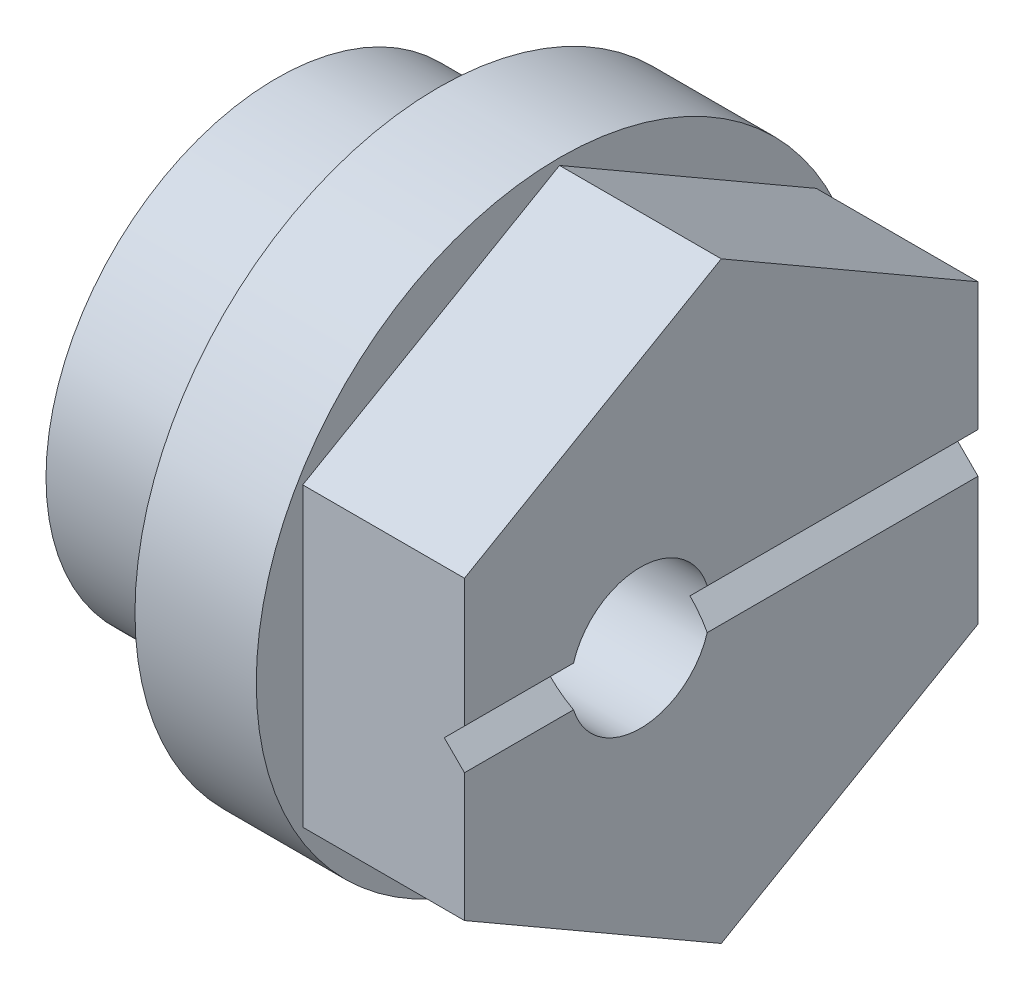
ISO-10303-21;
HEADER;
FILE_DESCRIPTION(('STEP AP214'),'2;1');
FILE_NAME('part.step','',(''),(''),'','','');
FILE_SCHEMA(('AUTOMOTIVE_DESIGN { 1 0 10303 214 1 1 1 1 }'));
ENDSEC;
DATA;
#1=APPLICATION_CONTEXT('core data for automotive mechanical design processes');
#2=APPLICATION_PROTOCOL_DEFINITION('international standard','automotive_design',2000,#1);
#3=PRODUCT_CONTEXT('',#1,'mechanical');
#4=PRODUCT('Part','Part','',(#3));
#5=PRODUCT_RELATED_PRODUCT_CATEGORY('part','',(#4));
#6=PRODUCT_DEFINITION_FORMATION('','',#4);
#7=PRODUCT_DEFINITION_CONTEXT('part definition',#1,'design');
#8=PRODUCT_DEFINITION('design','',#6,#7);
#9=PRODUCT_DEFINITION_SHAPE('','',#8);
#10=(LENGTH_UNIT() NAMED_UNIT(*) SI_UNIT(.MILLI.,.METRE.));
#11=(NAMED_UNIT(*) PLANE_ANGLE_UNIT() SI_UNIT($,.RADIAN.));
#12=(NAMED_UNIT(*) SI_UNIT($,.STERADIAN.) SOLID_ANGLE_UNIT());
#13=UNCERTAINTY_MEASURE_WITH_UNIT(LENGTH_MEASURE(1.E-05),#10,'distance_accuracy_value','');
#14=(GEOMETRIC_REPRESENTATION_CONTEXT(3) GLOBAL_UNCERTAINTY_ASSIGNED_CONTEXT((#13)) GLOBAL_UNIT_ASSIGNED_CONTEXT((#10,
#11,#12)) REPRESENTATION_CONTEXT('',''));
#15=CARTESIAN_POINT('',(0.,0.,0.));
#16=DIRECTION('',(0.,0.,1.));
#17=DIRECTION('',(1.,0.,0.));
#18=AXIS2_PLACEMENT_3D('',#15,#16,#17);
#19=CARTESIAN_POINT('',(10.5,0.,-7.5));
#20=DIRECTION('',(-0.707106781186549,-0.707106781186546,0.));
#21=DIRECTION('',(0.707106781186546,-0.707106781186549,0.));
#22=AXIS2_PLACEMENT_3D('',#19,#20,#21);
#23=PLANE('',#22);
#24=DIRECTION('',(0.,0.,1.));
#25=VECTOR('',#24,1.);
#26=CARTESIAN_POINT('',(10.5,0.,-7.5));
#27=LINE('',#26,#25);
#28=CARTESIAN_POINT('',(10.5,0.,-6.35));
#29=VERTEX_POINT('',#28);
#30=CARTESIAN_POINT('',(10.5,0.,0.272800000000005));
#31=VERTEX_POINT('',#30);
#32=EDGE_CURVE('E200',#29,#31,#27,.T.);
#33=ORIENTED_EDGE('',*,*,#32,.T.);
#34=CARTESIAN_POINT('',(10.5,0.,2.));
#35=DIRECTION('',(-0.707106781186549,-0.707106781186546,0.));
#36=DIRECTION('',(0.707106781186546,-0.707106781186549,0.));
#37=AXIS2_PLACEMENT_3D('',#34,#35,#36);
#38=ELLIPSE('',#37,2.44262966493079,1.72719999999999);
#39=CARTESIAN_POINT('',(11.,-0.499999999999998,0.346754755034825));
#40=VERTEX_POINT('',#39);
#41=EDGE_CURVE('E52',#31,#40,#38,.T.);
#42=ORIENTED_EDGE('',*,*,#41,.T.);
#43=DIRECTION('',(0.,0.,1.));
#44=VECTOR('',#43,1.);
#45=CARTESIAN_POINT('',(11.,-0.5,0.));
#46=LINE('',#45,#44);
#47=CARTESIAN_POINT('',(11.,-0.5,-6.35));
#48=VERTEX_POINT('',#47);
#49=EDGE_CURVE('E11',#48,#40,#46,.T.);
#50=ORIENTED_EDGE('',*,*,#49,.F.);
#51=DIRECTION('',(0.707106781186546,-0.707106781186549,0.));
#52=VECTOR('',#51,1.);
#53=CARTESIAN_POINT('',(8.91691289532294,1.58308710467707,-6.35));
#54=LINE('',#53,#52);
#55=EDGE_CURVE('E182',#29,#48,#54,.T.);
#56=ORIENTED_EDGE('',*,*,#55,.F.);
#57=EDGE_LOOP('',(#33,#42,#50,#56));
#58=FACE_BOUND('',#57,.T.);
#59=ADVANCED_FACE('F36',(#58),#23,.F.);
#60=CARTESIAN_POINT('',(11.,0.5,-7.5));
#61=DIRECTION('',(-0.707106781186548,0.707106781186547,0.));
#62=DIRECTION('',(-0.707106781186547,-0.707106781186548,0.));
#63=AXIS2_PLACEMENT_3D('',#60,#61,#62);
#64=PLANE('',#63);
#65=CARTESIAN_POINT('',(10.5,0.,3.72719999999999));
#66=VERTEX_POINT('',#65);
#67=CARTESIAN_POINT('',(10.5,0.,6.35));
#68=VERTEX_POINT('',#67);
#69=EDGE_CURVE('E202',#66,#68,#27,.T.);
#70=ORIENTED_EDGE('',*,*,#69,.F.);
#71=CARTESIAN_POINT('',(10.5,0.,2.));
#72=DIRECTION('',(-0.707106781186548,0.707106781186547,0.));
#73=DIRECTION('',(0.707106781186547,0.707106781186548,0.));
#74=AXIS2_PLACEMENT_3D('',#71,#72,#73);
#75=ELLIPSE('',#74,2.4426296649308,1.72719999999999);
#76=CARTESIAN_POINT('',(11.,0.499999999999999,3.65324524496517));
#77=VERTEX_POINT('',#76);
#78=EDGE_CURVE('E221',#66,#77,#75,.T.);
#79=ORIENTED_EDGE('',*,*,#78,.T.);
#80=DIRECTION('',(0.,0.,-1.));
#81=VECTOR('',#80,1.);
#82=CARTESIAN_POINT('',(11.,0.5,0.));
#83=LINE('',#82,#81);
#84=CARTESIAN_POINT('',(11.,0.5,6.35));
#85=VERTEX_POINT('',#84);
#86=EDGE_CURVE('E135',#85,#77,#83,.T.);
#87=ORIENTED_EDGE('',*,*,#86,.F.);
#88=DIRECTION('',(-0.707106781186547,-0.707106781186548,0.));
#89=VECTOR('',#88,1.);
#90=CARTESIAN_POINT('',(11.,0.5,6.35));
#91=LINE('',#90,#89);
#92=EDGE_CURVE('E203',#85,#68,#91,.T.);
#93=ORIENTED_EDGE('',*,*,#92,.T.);
#94=EDGE_LOOP('',(#70,#79,#87,#93));
#95=FACE_BOUND('',#94,.T.);
#96=ADVANCED_FACE('F255',(#95),#64,.F.);
#97=CARTESIAN_POINT('',(4.,7.5,0.));
#98=DIRECTION('',(-1.,0.,0.));
#99=DIRECTION('',(0.,0.,1.));
#100=AXIS2_PLACEMENT_3D('',#97,#98,#99);
#101=PLANE('',#100);
#102=CARTESIAN_POINT('',(4.,0.,0.));
#103=DIRECTION('',(1.,0.,0.));
#104=DIRECTION('',(0.,0.,-1.));
#105=AXIS2_PLACEMENT_3D('',#102,#103,#104);
#106=CIRCLE('',#105,7.5);
#107=CARTESIAN_POINT('',(4.,0.,-7.5));
#108=VERTEX_POINT('',#107);
#109=EDGE_CURVE('E142',#108,#108,#106,.T.);
#110=ORIENTED_EDGE('',*,*,#109,.F.);
#111=EDGE_LOOP('',(#110));
#112=FACE_BOUND('',#111,.T.);
#113=CARTESIAN_POINT('',(4.,0.,0.));
#114=DIRECTION('',(-1.,0.,0.));
#115=DIRECTION('',(0.,0.,1.));
#116=AXIS2_PLACEMENT_3D('',#113,#114,#115);
#117=CIRCLE('',#116,5.7);
#118=CARTESIAN_POINT('',(4.,0.,5.7));
#119=VERTEX_POINT('',#118);
#120=EDGE_CURVE('E210',#119,#119,#117,.T.);
#121=ORIENTED_EDGE('',*,*,#120,.F.);
#122=EDGE_LOOP('',(#121));
#123=FACE_BOUND('',#122,.T.);
#124=ADVANCED_FACE('F278',(#112,#123),#101,.T.);
#125=CARTESIAN_POINT('',(11.,-7.33234841870825,0.));
#126=DIRECTION('',(-1.,0.,0.));
#127=DIRECTION('',(0.,0.,1.));
#128=AXIS2_PLACEMENT_3D('',#125,#126,#127);
#129=PLANE('',#128);
#130=ORIENTED_EDGE('',*,*,#49,.T.);
#131=CARTESIAN_POINT('',(11.,0.,2.));
#132=DIRECTION('',(1.,0.,0.));
#133=DIRECTION('',(0.,0.,-1.));
#134=AXIS2_PLACEMENT_3D('',#131,#132,#133);
#135=CIRCLE('',#134,1.72719999999999);
#136=CARTESIAN_POINT('',(11.,-0.500000000000001,3.65324524496518));
#137=VERTEX_POINT('',#136);
#138=EDGE_CURVE('E136',#137,#40,#135,.T.);
#139=ORIENTED_EDGE('',*,*,#138,.F.);
#140=CARTESIAN_POINT('',(11.,-0.5,6.35));
#141=VERTEX_POINT('',#140);
#142=EDGE_CURVE('E45',#137,#141,#46,.T.);
#143=ORIENTED_EDGE('',*,*,#142,.T.);
#144=DIRECTION('',(0.,-1.,0.));
#145=VECTOR('',#144,1.);
#146=CARTESIAN_POINT('',(11.,-3.66617420935412,6.35));
#147=LINE('',#146,#145);
#148=CARTESIAN_POINT('',(11.,-3.66617420935412,6.35));
#149=VERTEX_POINT('',#148);
#150=EDGE_CURVE('E186',#141,#149,#147,.T.);
#151=ORIENTED_EDGE('',*,*,#150,.T.);
#152=DIRECTION('',(0.,-0.5,-0.866025403784439));
#153=VECTOR('',#152,1.);
#154=CARTESIAN_POINT('',(11.,-7.33234841870825,0.));
#155=LINE('',#154,#153);
#156=CARTESIAN_POINT('',(11.,-7.33234841870825,0.));
#157=VERTEX_POINT('',#156);
#158=EDGE_CURVE('E166',#149,#157,#155,.T.);
#159=ORIENTED_EDGE('',*,*,#158,.T.);
#160=DIRECTION('',(0.,0.5,-0.866025403784439));
#161=VECTOR('',#160,1.);
#162=CARTESIAN_POINT('',(11.,-3.66617420935412,-6.35));
#163=LINE('',#162,#161);
#164=CARTESIAN_POINT('',(11.,-3.66617420935412,-6.35));
#165=VERTEX_POINT('',#164);
#166=EDGE_CURVE('E169',#157,#165,#163,.T.);
#167=ORIENTED_EDGE('',*,*,#166,.T.);
#168=DIRECTION('',(0.,1.,0.));
#169=VECTOR('',#168,1.);
#170=CARTESIAN_POINT('',(11.,3.66617420935412,-6.35));
#171=LINE('',#170,#169);
#172=EDGE_CURVE('E191',#165,#48,#171,.T.);
#173=ORIENTED_EDGE('',*,*,#172,.T.);
#174=EDGE_LOOP('',(#130,#139,#143,#151,#159,#167,#173));
#175=FACE_BOUND('',#174,.T.);
#176=ADVANCED_FACE('F229',(#175),#129,.F.);
#177=CARTESIAN_POINT('',(7.,0.,0.));
#178=DIRECTION('',(1.,0.,0.));
#179=DIRECTION('',(0.,0.,-1.));
#180=AXIS2_PLACEMENT_3D('',#177,#178,#179);
#181=PLANE('',#180);
#182=CARTESIAN_POINT('',(7.,0.,0.));
#183=DIRECTION('',(1.,0.,0.));
#184=DIRECTION('',(0.,0.,-1.));
#185=AXIS2_PLACEMENT_3D('',#182,#183,#184);
#186=CIRCLE('',#185,7.5);
#187=CARTESIAN_POINT('',(7.,0.,-7.5));
#188=VERTEX_POINT('',#187);
#189=EDGE_CURVE('E145',#188,#188,#186,.T.);
#190=ORIENTED_EDGE('',*,*,#189,.T.);
#191=EDGE_LOOP('',(#190));
#192=FACE_BOUND('',#191,.T.);
#193=DIRECTION('',(0.,1.,0.));
#194=VECTOR('',#193,1.);
#195=CARTESIAN_POINT('',(7.,3.66617420935412,-6.35));
#196=LINE('',#195,#194);
#197=CARTESIAN_POINT('',(7.,-3.66617420935412,-6.35));
#198=VERTEX_POINT('',#197);
#199=CARTESIAN_POINT('',(7.,3.66617420935412,-6.35));
#200=VERTEX_POINT('',#199);
#201=EDGE_CURVE('E177',#198,#200,#196,.T.);
#202=ORIENTED_EDGE('',*,*,#201,.F.);
#203=DIRECTION('',(0.,0.5,-0.866025403784439));
#204=VECTOR('',#203,1.);
#205=CARTESIAN_POINT('',(7.,-3.66617420935412,-6.35));
#206=LINE('',#205,#204);
#207=CARTESIAN_POINT('',(7.,-7.33234841870825,0.));
#208=VERTEX_POINT('',#207);
#209=EDGE_CURVE('E179',#208,#198,#206,.T.);
#210=ORIENTED_EDGE('',*,*,#209,.F.);
#211=DIRECTION('',(0.,-0.5,-0.866025403784439));
#212=VECTOR('',#211,1.);
#213=CARTESIAN_POINT('',(7.,-7.33234841870825,0.));
#214=LINE('',#213,#212);
#215=CARTESIAN_POINT('',(7.,-3.66617420935413,6.35));
#216=VERTEX_POINT('',#215);
#217=EDGE_CURVE('E167',#216,#208,#214,.T.);
#218=ORIENTED_EDGE('',*,*,#217,.F.);
#219=DIRECTION('',(0.,-1.,0.));
#220=VECTOR('',#219,1.);
#221=CARTESIAN_POINT('',(7.,-3.66617420935412,6.35));
#222=LINE('',#221,#220);
#223=CARTESIAN_POINT('',(7.,3.66617420935412,6.35));
#224=VERTEX_POINT('',#223);
#225=EDGE_CURVE('E170',#224,#216,#222,.T.);
#226=ORIENTED_EDGE('',*,*,#225,.F.);
#227=DIRECTION('',(0.,-0.5,0.866025403784438));
#228=VECTOR('',#227,1.);
#229=CARTESIAN_POINT('',(7.,3.66617420935412,6.35));
#230=LINE('',#229,#228);
#231=CARTESIAN_POINT('',(7.,7.33234841870825,0.));
#232=VERTEX_POINT('',#231);
#233=EDGE_CURVE('E173',#232,#224,#230,.T.);
#234=ORIENTED_EDGE('',*,*,#233,.F.);
#235=DIRECTION('',(0.,0.500000000000001,0.866025403784438));
#236=VECTOR('',#235,1.);
#237=CARTESIAN_POINT('',(7.,7.33234841870825,0.));
#238=LINE('',#237,#236);
#239=EDGE_CURVE('E175',#200,#232,#238,.T.);
#240=ORIENTED_EDGE('',*,*,#239,.F.);
#241=EDGE_LOOP('',(#202,#210,#218,#226,#234,#240));
#242=FACE_BOUND('',#241,.T.);
#243=ADVANCED_FACE('F269',(#192,#242),#181,.T.);
#244=CARTESIAN_POINT('',(4.,0.,0.));
#245=DIRECTION('',(1.,0.,0.));
#246=DIRECTION('',(0.,0.,-1.));
#247=AXIS2_PLACEMENT_3D('',#244,#245,#246);
#248=CYLINDRICAL_SURFACE('',#247,7.5);
#249=ORIENTED_EDGE('',*,*,#109,.T.);
#250=EDGE_LOOP('',(#249));
#251=FACE_BOUND('',#250,.T.);
#252=ORIENTED_EDGE('',*,*,#189,.F.);
#253=EDGE_LOOP('',(#252));
#254=FACE_BOUND('',#253,.T.);
#255=ADVANCED_FACE('F38',(#251,#254),#248,.T.);
#256=CARTESIAN_POINT('',(11.,-3.66617420935412,-6.35));
#257=DIRECTION('',(0.,0.866025403784439,0.5));
#258=DIRECTION('',(0.,-0.5,0.866025403784439));
#259=AXIS2_PLACEMENT_3D('',#256,#257,#258);
#260=PLANE('',#259);
#261=ORIENTED_EDGE('',*,*,#209,.T.);
#262=DIRECTION('',(-1.,0.,0.));
#263=VECTOR('',#262,1.);
#264=CARTESIAN_POINT('',(11.,-3.66617420935412,-6.35));
#265=LINE('',#264,#263);
#266=EDGE_CURVE('E150',#165,#198,#265,.T.);
#267=ORIENTED_EDGE('',*,*,#266,.F.);
#268=ORIENTED_EDGE('',*,*,#166,.F.);
#269=DIRECTION('',(-1.,0.,0.));
#270=VECTOR('',#269,1.);
#271=CARTESIAN_POINT('',(11.,-7.33234841870825,0.));
#272=LINE('',#271,#270);
#273=EDGE_CURVE('E163',#157,#208,#272,.T.);
#274=ORIENTED_EDGE('',*,*,#273,.T.);
#275=EDGE_LOOP('',(#261,#267,#268,#274));
#276=FACE_BOUND('',#275,.T.);
#277=ADVANCED_FACE('F266',(#276),#260,.F.);
#278=CARTESIAN_POINT('',(11.,3.66617420935412,-6.35));
#279=DIRECTION('',(0.,0.,1.));
#280=DIRECTION('',(1.,0.,0.));
#281=AXIS2_PLACEMENT_3D('',#278,#279,#280);
#282=PLANE('',#281);
#283=DIRECTION('',(-0.707106781186547,-0.707106781186548,0.));
#284=VECTOR('',#283,1.);
#285=CARTESIAN_POINT('',(12.5830871046771,2.08308710467706,-6.35));
#286=LINE('',#285,#284);
#287=CARTESIAN_POINT('',(11.,0.5,-6.35));
#288=VERTEX_POINT('',#287);
#289=EDGE_CURVE('E140',#288,#29,#286,.T.);
#290=ORIENTED_EDGE('',*,*,#289,.T.);
#291=ORIENTED_EDGE('',*,*,#55,.T.);
#292=ORIENTED_EDGE('',*,*,#172,.F.);
#293=ORIENTED_EDGE('',*,*,#266,.T.);
#294=ORIENTED_EDGE('',*,*,#201,.T.);
#295=DIRECTION('',(-1.,0.,0.));
#296=VECTOR('',#295,1.);
#297=CARTESIAN_POINT('',(11.,3.66617420935412,-6.35));
#298=LINE('',#297,#296);
#299=CARTESIAN_POINT('',(11.,3.66617420935412,-6.35));
#300=VERTEX_POINT('',#299);
#301=EDGE_CURVE('E152',#300,#200,#298,.T.);
#302=ORIENTED_EDGE('',*,*,#301,.F.);
#303=EDGE_CURVE('E194',#288,#300,#171,.T.);
#304=ORIENTED_EDGE('',*,*,#303,.F.);
#305=EDGE_LOOP('',(#290,#291,#292,#293,#294,#302,#304));
#306=FACE_BOUND('',#305,.T.);
#307=ADVANCED_FACE('F234',(#306),#282,.F.);
#308=CARTESIAN_POINT('',(11.,7.33234841870825,0.));
#309=DIRECTION('',(0.,-0.866025403784438,0.500000000000001));
#310=DIRECTION('',(0.,-0.500000000000001,-0.866025403784438));
#311=AXIS2_PLACEMENT_3D('',#308,#309,#310);
#312=PLANE('',#311);
#313=ORIENTED_EDGE('',*,*,#239,.T.);
#314=DIRECTION('',(-1.,0.,0.));
#315=VECTOR('',#314,1.);
#316=CARTESIAN_POINT('',(11.,7.33234841870825,0.));
#317=LINE('',#316,#315);
#318=CARTESIAN_POINT('',(11.,7.33234841870825,0.));
#319=VERTEX_POINT('',#318);
#320=EDGE_CURVE('E155',#319,#232,#317,.T.);
#321=ORIENTED_EDGE('',*,*,#320,.F.);
#322=DIRECTION('',(0.,0.500000000000001,0.866025403784438));
#323=VECTOR('',#322,1.);
#324=CARTESIAN_POINT('',(11.,7.33234841870825,0.));
#325=LINE('',#324,#323);
#326=EDGE_CURVE('E189',#300,#319,#325,.T.);
#327=ORIENTED_EDGE('',*,*,#326,.F.);
#328=ORIENTED_EDGE('',*,*,#301,.T.);
#329=EDGE_LOOP('',(#313,#321,#327,#328));
#330=FACE_BOUND('',#329,.T.);
#331=ADVANCED_FACE('F241',(#330),#312,.F.);
#332=CARTESIAN_POINT('',(11.,3.66617420935412,6.35));
#333=DIRECTION('',(0.,-0.866025403784439,-0.5));
#334=DIRECTION('',(0.,0.5,-0.866025403784439));
#335=AXIS2_PLACEMENT_3D('',#332,#333,#334);
#336=PLANE('',#335);
#337=ORIENTED_EDGE('',*,*,#233,.T.);
#338=DIRECTION('',(-1.,0.,0.));
#339=VECTOR('',#338,1.);
#340=CARTESIAN_POINT('',(11.,3.66617420935412,6.35));
#341=LINE('',#340,#339);
#342=CARTESIAN_POINT('',(11.,3.66617420935412,6.35));
#343=VERTEX_POINT('',#342);
#344=EDGE_CURVE('E158',#343,#224,#341,.T.);
#345=ORIENTED_EDGE('',*,*,#344,.F.);
#346=DIRECTION('',(0.,-0.5,0.866025403784438));
#347=VECTOR('',#346,1.);
#348=CARTESIAN_POINT('',(11.,3.66617420935412,6.35));
#349=LINE('',#348,#347);
#350=EDGE_CURVE('E187',#319,#343,#349,.T.);
#351=ORIENTED_EDGE('',*,*,#350,.F.);
#352=ORIENTED_EDGE('',*,*,#320,.T.);
#353=EDGE_LOOP('',(#337,#345,#351,#352));
#354=FACE_BOUND('',#353,.T.);
#355=ADVANCED_FACE('F245',(#354),#336,.F.);
#356=CARTESIAN_POINT('',(11.,-3.66617420935412,6.35));
#357=DIRECTION('',(0.,0.,-1.));
#358=DIRECTION('',(0.,1.,0.));
#359=AXIS2_PLACEMENT_3D('',#356,#357,#358);
#360=PLANE('',#359);
#361=ORIENTED_EDGE('',*,*,#150,.F.);
#362=DIRECTION('',(0.707106781186546,-0.707106781186549,0.));
#363=VECTOR('',#362,1.);
#364=CARTESIAN_POINT('',(10.5,0.,6.35));
#365=LINE('',#364,#363);
#366=EDGE_CURVE('E206',#68,#141,#365,.T.);
#367=ORIENTED_EDGE('',*,*,#366,.F.);
#368=ORIENTED_EDGE('',*,*,#92,.F.);
#369=EDGE_CURVE('E184',#343,#85,#147,.T.);
#370=ORIENTED_EDGE('',*,*,#369,.F.);
#371=ORIENTED_EDGE('',*,*,#344,.T.);
#372=ORIENTED_EDGE('',*,*,#225,.T.);
#373=DIRECTION('',(-1.,0.,0.));
#374=VECTOR('',#373,1.);
#375=CARTESIAN_POINT('',(11.,-3.66617420935412,6.35));
#376=LINE('',#375,#374);
#377=EDGE_CURVE('E161',#149,#216,#376,.T.);
#378=ORIENTED_EDGE('',*,*,#377,.F.);
#379=EDGE_LOOP('',(#361,#367,#368,#370,#371,#372,#378));
#380=FACE_BOUND('',#379,.T.);
#381=ADVANCED_FACE('F251',(#380),#360,.F.);
#382=CARTESIAN_POINT('',(11.,-7.33234841870825,0.));
#383=DIRECTION('',(0.,0.866025403784439,-0.5));
#384=DIRECTION('',(0.,0.5,0.866025403784439));
#385=AXIS2_PLACEMENT_3D('',#382,#383,#384);
#386=PLANE('',#385);
#387=ORIENTED_EDGE('',*,*,#217,.T.);
#388=ORIENTED_EDGE('',*,*,#273,.F.);
#389=ORIENTED_EDGE('',*,*,#158,.F.);
#390=ORIENTED_EDGE('',*,*,#377,.T.);
#391=EDGE_LOOP('',(#387,#388,#389,#390));
#392=FACE_BOUND('',#391,.T.);
#393=ADVANCED_FACE('F263',(#392),#386,.F.);
#394=ORIENTED_EDGE('',*,*,#86,.T.);
#395=CARTESIAN_POINT('',(11.,0.500000000000003,0.346754755034825));
#396=VERTEX_POINT('',#395);
#397=EDGE_CURVE('E126',#396,#77,#135,.T.);
#398=ORIENTED_EDGE('',*,*,#397,.F.);
#399=EDGE_CURVE('E60',#396,#288,#83,.T.);
#400=ORIENTED_EDGE('',*,*,#399,.T.);
#401=ORIENTED_EDGE('',*,*,#303,.T.);
#402=ORIENTED_EDGE('',*,*,#326,.T.);
#403=ORIENTED_EDGE('',*,*,#350,.T.);
#404=ORIENTED_EDGE('',*,*,#369,.T.);
#405=EDGE_LOOP('',(#394,#398,#400,#401,#402,#403,#404));
#406=FACE_BOUND('',#405,.T.);
#407=ADVANCED_FACE('F133',(#406),#129,.F.);
#408=ORIENTED_EDGE('',*,*,#142,.F.);
#409=CARTESIAN_POINT('',(10.5,0.,2.));
#410=DIRECTION('',(-0.707106781186549,-0.707106781186546,0.));
#411=DIRECTION('',(0.707106781186546,-0.707106781186549,0.));
#412=AXIS2_PLACEMENT_3D('',#409,#410,#411);
#413=ELLIPSE('',#412,2.44262966493079,1.72719999999999);
#414=EDGE_CURVE('E223',#137,#66,#413,.T.);
#415=ORIENTED_EDGE('',*,*,#414,.T.);
#416=ORIENTED_EDGE('',*,*,#69,.T.);
#417=ORIENTED_EDGE('',*,*,#366,.T.);
#418=EDGE_LOOP('',(#408,#415,#416,#417));
#419=FACE_BOUND('',#418,.T.);
#420=ADVANCED_FACE('F257',(#419),#23,.F.);
#421=ORIENTED_EDGE('',*,*,#399,.F.);
#422=CARTESIAN_POINT('',(10.5,0.,2.));
#423=DIRECTION('',(-0.707106781186548,0.707106781186547,0.));
#424=DIRECTION('',(0.707106781186547,0.707106781186548,0.));
#425=AXIS2_PLACEMENT_3D('',#422,#423,#424);
#426=ELLIPSE('',#425,2.4426296649308,1.72719999999999);
#427=EDGE_CURVE('E124',#396,#31,#426,.T.);
#428=ORIENTED_EDGE('',*,*,#427,.T.);
#429=ORIENTED_EDGE('',*,*,#32,.F.);
#430=ORIENTED_EDGE('',*,*,#289,.F.);
#431=EDGE_LOOP('',(#421,#428,#429,#430));
#432=FACE_BOUND('',#431,.T.);
#433=ADVANCED_FACE('F138',(#432),#64,.F.);
#434=CARTESIAN_POINT('',(0.,0.,0.));
#435=DIRECTION('',(1.,0.,0.));
#436=DIRECTION('',(0.,0.,-1.));
#437=AXIS2_PLACEMENT_3D('',#434,#435,#436);
#438=CYLINDRICAL_SURFACE('',#437,5.7);
#439=CARTESIAN_POINT('',(0.,0.,0.));
#440=DIRECTION('',(-1.,0.,0.));
#441=DIRECTION('',(0.,0.,1.));
#442=AXIS2_PLACEMENT_3D('',#439,#440,#441);
#443=CIRCLE('',#442,5.7);
#444=CARTESIAN_POINT('',(0.,0.,5.7));
#445=VERTEX_POINT('',#444);
#446=EDGE_CURVE('E209',#445,#445,#443,.T.);
#447=ORIENTED_EDGE('',*,*,#446,.F.);
#448=EDGE_LOOP('',(#447));
#449=FACE_BOUND('',#448,.T.);
#450=ORIENTED_EDGE('',*,*,#120,.T.);
#451=EDGE_LOOP('',(#450));
#452=FACE_BOUND('',#451,.T.);
#453=ADVANCED_FACE('F292',(#449,#452),#438,.T.);
#454=CARTESIAN_POINT('',(0.,0.,0.));
#455=DIRECTION('',(-1.,0.,0.));
#456=DIRECTION('',(0.,0.,1.));
#457=AXIS2_PLACEMENT_3D('',#454,#455,#456);
#458=PLANE('',#457);
#459=CARTESIAN_POINT('',(0.,0.,2.));
#460=DIRECTION('',(-1.,0.,0.));
#461=DIRECTION('',(0.,0.,1.));
#462=AXIS2_PLACEMENT_3D('',#459,#460,#461);
#463=CIRCLE('',#462,3.300000004);
#464=CARTESIAN_POINT('',(0.,0.,5.300000004));
#465=VERTEX_POINT('',#464);
#466=EDGE_CURVE('E218',#465,#465,#463,.T.);
#467=ORIENTED_EDGE('',*,*,#466,.F.);
#468=EDGE_LOOP('',(#467));
#469=FACE_BOUND('',#468,.T.);
#470=ORIENTED_EDGE('',*,*,#446,.T.);
#471=EDGE_LOOP('',(#470));
#472=FACE_BOUND('',#471,.T.);
#473=ADVANCED_FACE('F369',(#469,#472),#458,.T.);
#474=CARTESIAN_POINT('',(7.9375,0.793749999999998,2.));
#475=DIRECTION('',(1.,0.,0.));
#476=DIRECTION('',(0.,0.,-1.));
#477=AXIS2_PLACEMENT_3D('',#474,#475,#476);
#478=PLANE('',#477);
#479=CARTESIAN_POINT('',(7.9375,0.,2.));
#480=DIRECTION('',(1.,0.,0.));
#481=DIRECTION('',(0.,0.,-1.));
#482=AXIS2_PLACEMENT_3D('',#479,#480,#481);
#483=CIRCLE('',#482,1.72719999999999);
#484=CARTESIAN_POINT('',(7.9375,0.,0.272800000000007));
#485=VERTEX_POINT('',#484);
#486=EDGE_CURVE('E40',#485,#485,#483,.T.);
#487=ORIENTED_EDGE('',*,*,#486,.T.);
#488=EDGE_LOOP('',(#487));
#489=FACE_BOUND('',#488,.T.);
#490=CARTESIAN_POINT('',(7.9375,0.,2.));
#491=DIRECTION('',(-1.,0.,0.));
#492=DIRECTION('',(0.,0.,1.));
#493=AXIS2_PLACEMENT_3D('',#490,#491,#492);
#494=CIRCLE('',#493,3.300000004);
#495=CARTESIAN_POINT('',(7.9375,0.,5.300000004));
#496=VERTEX_POINT('',#495);
#497=EDGE_CURVE('E213',#496,#496,#494,.T.);
#498=ORIENTED_EDGE('',*,*,#497,.T.);
#499=EDGE_LOOP('',(#498));
#500=FACE_BOUND('',#499,.T.);
#501=ADVANCED_FACE('F378',(#489,#500),#478,.F.);
#502=CARTESIAN_POINT('',(0.,0.,2.));
#503=DIRECTION('',(-1.,0.,0.));
#504=DIRECTION('',(0.,0.,1.));
#505=AXIS2_PLACEMENT_3D('',#502,#503,#504);
#506=CYLINDRICAL_SURFACE('',#505,3.300000004);
#507=ORIENTED_EDGE('',*,*,#497,.F.);
#508=EDGE_LOOP('',(#507));
#509=FACE_BOUND('',#508,.T.);
#510=ORIENTED_EDGE('',*,*,#466,.T.);
#511=EDGE_LOOP('',(#510));
#512=FACE_BOUND('',#511,.T.);
#513=ADVANCED_FACE('F395',(#509,#512),#506,.F.);
#514=CARTESIAN_POINT('',(11.,0.,2.));
#515=DIRECTION('',(1.,0.,0.));
#516=DIRECTION('',(0.,0.,-1.));
#517=AXIS2_PLACEMENT_3D('',#514,#515,#516);
#518=CYLINDRICAL_SURFACE('',#517,1.72719999999999);
#519=ORIENTED_EDGE('',*,*,#486,.F.);
#520=EDGE_LOOP('',(#519));
#521=FACE_BOUND('',#520,.T.);
#522=ORIENTED_EDGE('',*,*,#414,.F.);
#523=ORIENTED_EDGE('',*,*,#138,.T.);
#524=ORIENTED_EDGE('',*,*,#41,.F.);
#525=ORIENTED_EDGE('',*,*,#427,.F.);
#526=ORIENTED_EDGE('',*,*,#397,.T.);
#527=ORIENTED_EDGE('',*,*,#78,.F.);
#528=EDGE_LOOP('',(#522,#523,#524,#525,#526,#527));
#529=FACE_BOUND('',#528,.T.);
#530=ADVANCED_FACE('F125',(#521,#529),#518,.F.);
#531=CLOSED_SHELL('',(#59,#96,#124,#176,#243,#255,#277,#307,#331,#355,#381,#393,#407,#420,#433,
#453,#473,#501,#513,#530));
#532=MANIFOLD_SOLID_BREP('B2',#531);
#533=ADVANCED_BREP_SHAPE_REPRESENTATION('',(#18,#532),#14);
#534=SHAPE_DEFINITION_REPRESENTATION(#9,#533);
ENDSEC;
END-ISO-10303-21;
